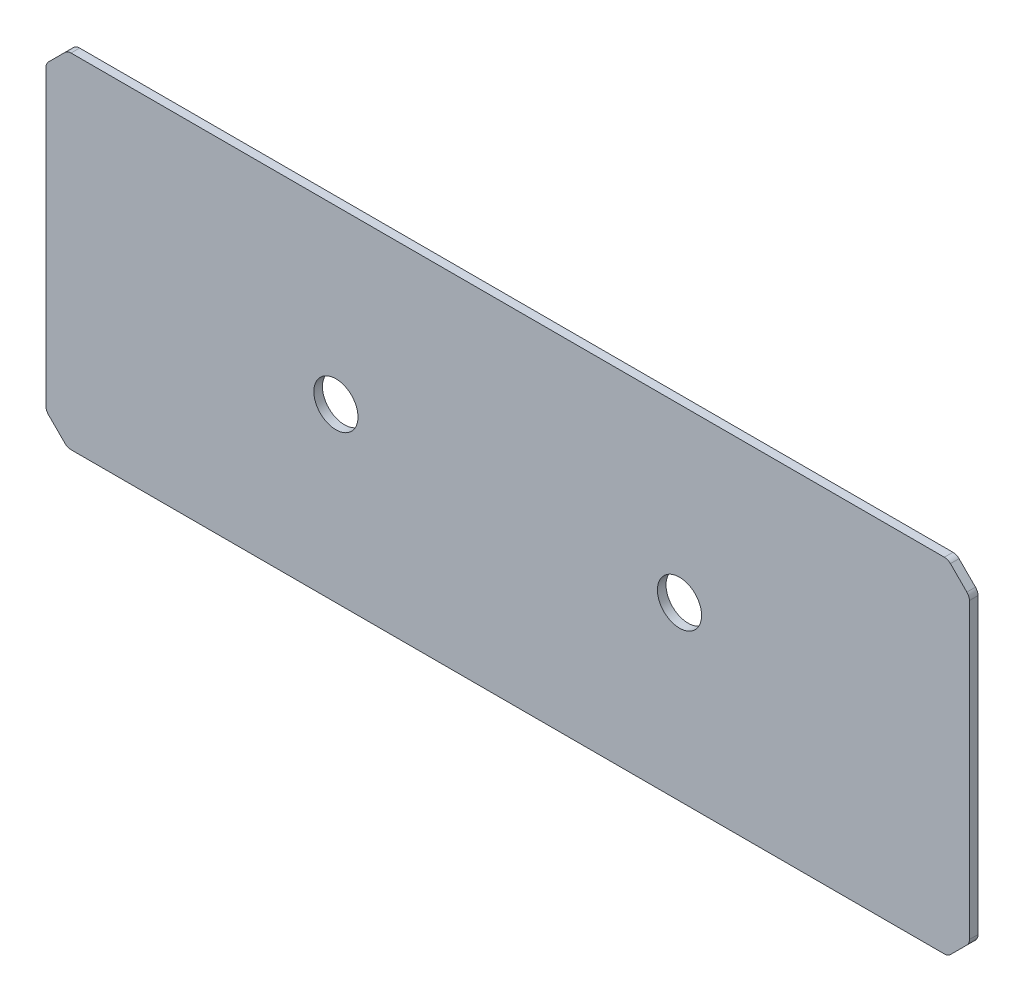
ISO-10303-21;
HEADER;
FILE_DESCRIPTION(('STEP AP214'),'2;1');
FILE_NAME('part.step','',(''),(''),'','','');
FILE_SCHEMA(('AUTOMOTIVE_DESIGN { 1 0 10303 214 1 1 1 1 }'));
ENDSEC;
DATA;
#1=APPLICATION_CONTEXT('core data for automotive mechanical design processes');
#2=APPLICATION_PROTOCOL_DEFINITION('international standard','automotive_design',2000,#1);
#3=PRODUCT_CONTEXT('',#1,'mechanical');
#4=PRODUCT('Part','Part','',(#3));
#5=PRODUCT_RELATED_PRODUCT_CATEGORY('part','',(#4));
#6=PRODUCT_DEFINITION_FORMATION('','',#4);
#7=PRODUCT_DEFINITION_CONTEXT('part definition',#1,'design');
#8=PRODUCT_DEFINITION('design','',#6,#7);
#9=PRODUCT_DEFINITION_SHAPE('','',#8);
#10=(LENGTH_UNIT() NAMED_UNIT(*) SI_UNIT(.MILLI.,.METRE.));
#11=(NAMED_UNIT(*) PLANE_ANGLE_UNIT() SI_UNIT($,.RADIAN.));
#12=(NAMED_UNIT(*) SI_UNIT($,.STERADIAN.) SOLID_ANGLE_UNIT());
#13=UNCERTAINTY_MEASURE_WITH_UNIT(LENGTH_MEASURE(1.E-05),#10,'distance_accuracy_value','');
#14=(GEOMETRIC_REPRESENTATION_CONTEXT(3) GLOBAL_UNCERTAINTY_ASSIGNED_CONTEXT((#13)) GLOBAL_UNIT_ASSIGNED_CONTEXT((#10,
#11,#12)) REPRESENTATION_CONTEXT('',''));
#15=CARTESIAN_POINT('',(0.,0.,0.));
#16=DIRECTION('',(0.,0.,1.));
#17=DIRECTION('',(1.,0.,0.));
#18=AXIS2_PLACEMENT_3D('',#15,#16,#17);
#19=CARTESIAN_POINT('',(0.,-88.046001815833,1.27));
#20=DIRECTION('',(-1.,0.,0.));
#21=DIRECTION('',(0.,0.,1.));
#22=AXIS2_PLACEMENT_3D('',#19,#20,#21);
#23=PLANE('',#22);
#24=DIRECTION('',(0.,1.,0.));
#25=VECTOR('',#24,1.);
#26=CARTESIAN_POINT('',(0.,-88.046001815833,1.27));
#27=LINE('',#26,#25);
#28=CARTESIAN_POINT('',(0.,3.70105122421385,1.27));
#29=VERTEX_POINT('',#28);
#30=CARTESIAN_POINT('',(0.,47.0989487757862,1.27));
#31=VERTEX_POINT('',#30);
#32=EDGE_CURVE('E302',#29,#31,#27,.T.);
#33=ORIENTED_EDGE('',*,*,#32,.T.);
#34=DIRECTION('',(0.,0.,1.));
#35=VECTOR('',#34,1.);
#36=CARTESIAN_POINT('',(0.,47.0989487757862,1.27));
#37=LINE('',#36,#35);
#38=CARTESIAN_POINT('',(0.,47.0989487757862,0.));
#39=VERTEX_POINT('',#38);
#40=EDGE_CURVE('E198',#31,#39,#37,.F.);
#41=ORIENTED_EDGE('',*,*,#40,.T.);
#42=DIRECTION('',(0.,1.,0.));
#43=VECTOR('',#42,1.);
#44=CARTESIAN_POINT('',(0.,-88.046001815833,0.));
#45=LINE('',#44,#43);
#46=CARTESIAN_POINT('',(0.,3.70105122421385,0.));
#47=VERTEX_POINT('',#46);
#48=EDGE_CURVE('E191',#47,#39,#45,.T.);
#49=ORIENTED_EDGE('',*,*,#48,.F.);
#50=DIRECTION('',(0.,0.,1.));
#51=VECTOR('',#50,1.);
#52=CARTESIAN_POINT('',(0.,3.70105122421385,1.27));
#53=LINE('',#52,#51);
#54=EDGE_CURVE('E204',#47,#29,#53,.T.);
#55=ORIENTED_EDGE('',*,*,#54,.T.);
#56=EDGE_LOOP('',(#33,#41,#49,#55));
#57=FACE_BOUND('',#56,.T.);
#58=ADVANCED_FACE('F72',(#57),#23,.T.);
#59=CARTESIAN_POINT('',(68.2625,-88.046001815833,0.));
#60=DIRECTION('',(0.,0.,1.));
#61=DIRECTION('',(1.,0.,0.));
#62=AXIS2_PLACEMENT_3D('',#59,#60,#61);
#63=PLANE('',#62);
#64=CARTESIAN_POINT('',(42.8625,25.4,0.));
#65=DIRECTION('',(0.,0.,1.));
#66=DIRECTION('',(1.,0.,0.));
#67=AXIS2_PLACEMENT_3D('',#64,#65,#66);
#68=CIRCLE('',#67,3.26389999999999);
#69=CARTESIAN_POINT('',(46.1264,25.4,0.));
#70=VERTEX_POINT('',#69);
#71=EDGE_CURVE('E371',#70,#70,#68,.T.);
#72=ORIENTED_EDGE('',*,*,#71,.T.);
#73=EDGE_LOOP('',(#72));
#74=FACE_BOUND('',#73,.T.);
#75=CARTESIAN_POINT('',(93.6625,25.4,0.));
#76=DIRECTION('',(0.,0.,1.));
#77=DIRECTION('',(1.,0.,0.));
#78=AXIS2_PLACEMENT_3D('',#75,#76,#77);
#79=CIRCLE('',#78,3.26389999999998);
#80=CARTESIAN_POINT('',(96.9264,25.4,0.));
#81=VERTEX_POINT('',#80);
#82=EDGE_CURVE('E294',#81,#81,#79,.T.);
#83=ORIENTED_EDGE('',*,*,#82,.T.);
#84=EDGE_LOOP('',(#83));
#85=FACE_BOUND('',#84,.T.);
#86=ORIENTED_EDGE('',*,*,#48,.T.);
#87=CARTESIAN_POINT('',(1.27,47.0989487757862,0.));
#88=DIRECTION('',(0.,0.,1.));
#89=DIRECTION('',(1.,0.,0.));
#90=AXIS2_PLACEMENT_3D('',#87,#88,#89);
#91=CIRCLE('',#90,1.27);
#92=CARTESIAN_POINT('',(0.3719743878931,47.9969743878932,0.));
#93=VERTEX_POINT('',#92);
#94=EDGE_CURVE('E230',#39,#93,#91,.F.);
#95=ORIENTED_EDGE('',*,*,#94,.T.);
#96=DIRECTION('',(-0.707106781186551,-0.707106781186544,0.));
#97=VECTOR('',#96,1.);
#98=CARTESIAN_POINT('',(0.,47.6250000000001,0.));
#99=LINE('',#98,#97);
#100=CARTESIAN_POINT('',(2.80302561210687,50.4280256121069,0.));
#101=VERTEX_POINT('',#100);
#102=EDGE_CURVE('E312',#93,#101,#99,.F.);
#103=ORIENTED_EDGE('',*,*,#102,.T.);
#104=CARTESIAN_POINT('',(3.70105122421378,49.53,0.));
#105=DIRECTION('',(0.,0.,1.));
#106=DIRECTION('',(1.,0.,0.));
#107=AXIS2_PLACEMENT_3D('',#104,#105,#106);
#108=CIRCLE('',#107,1.27);
#109=CARTESIAN_POINT('',(3.70105122421378,50.8,0.));
#110=VERTEX_POINT('',#109);
#111=EDGE_CURVE('E228',#101,#110,#108,.F.);
#112=ORIENTED_EDGE('',*,*,#111,.T.);
#113=DIRECTION('',(1.,0.,0.));
#114=VECTOR('',#113,1.);
#115=CARTESIAN_POINT('',(68.2625,50.8,0.));
#116=LINE('',#115,#114);
#117=CARTESIAN_POINT('',(132.823948775786,50.8,0.));
#118=VERTEX_POINT('',#117);
#119=EDGE_CURVE('E208',#110,#118,#116,.T.);
#120=ORIENTED_EDGE('',*,*,#119,.T.);
#121=CARTESIAN_POINT('',(132.823948775786,49.53,0.));
#122=DIRECTION('',(0.,0.,1.));
#123=DIRECTION('',(1.,0.,0.));
#124=AXIS2_PLACEMENT_3D('',#121,#122,#123);
#125=CIRCLE('',#124,1.27);
#126=CARTESIAN_POINT('',(133.721974387893,50.4280256121069,0.));
#127=VERTEX_POINT('',#126);
#128=EDGE_CURVE('E226',#118,#127,#125,.F.);
#129=ORIENTED_EDGE('',*,*,#128,.T.);
#130=DIRECTION('',(0.707106781186554,-0.707106781186541,0.));
#131=VECTOR('',#130,1.);
#132=CARTESIAN_POINT('',(133.35,50.8,0.));
#133=LINE('',#132,#131);
#134=CARTESIAN_POINT('',(136.153025612107,47.9969743878931,0.));
#135=VERTEX_POINT('',#134);
#136=EDGE_CURVE('E309',#127,#135,#133,.T.);
#137=ORIENTED_EDGE('',*,*,#136,.T.);
#138=CARTESIAN_POINT('',(135.255,47.0989487757862,0.));
#139=DIRECTION('',(0.,0.,1.));
#140=DIRECTION('',(1.,0.,0.));
#141=AXIS2_PLACEMENT_3D('',#138,#139,#140);
#142=CIRCLE('',#141,1.27);
#143=CARTESIAN_POINT('',(136.525,47.0989487757862,0.));
#144=VERTEX_POINT('',#143);
#145=EDGE_CURVE('E224',#135,#144,#142,.F.);
#146=ORIENTED_EDGE('',*,*,#145,.T.);
#147=DIRECTION('',(0.,1.,0.));
#148=VECTOR('',#147,1.);
#149=CARTESIAN_POINT('',(136.525,-88.046001815833,0.));
#150=LINE('',#149,#148);
#151=CARTESIAN_POINT('',(136.525,3.70105122421387,0.));
#152=VERTEX_POINT('',#151);
#153=EDGE_CURVE('E293',#152,#144,#150,.T.);
#154=ORIENTED_EDGE('',*,*,#153,.F.);
#155=CARTESIAN_POINT('',(135.255,3.70105122421387,0.));
#156=DIRECTION('',(0.,0.,1.));
#157=DIRECTION('',(1.,0.,0.));
#158=AXIS2_PLACEMENT_3D('',#155,#156,#157);
#159=CIRCLE('',#158,1.27);
#160=CARTESIAN_POINT('',(136.153025612107,2.80302561210695,0.));
#161=VERTEX_POINT('',#160);
#162=EDGE_CURVE('E222',#152,#161,#159,.F.);
#163=ORIENTED_EDGE('',*,*,#162,.T.);
#164=DIRECTION('',(0.707106781186549,0.707106781186546,0.));
#165=VECTOR('',#164,1.);
#166=CARTESIAN_POINT('',(136.525,3.17500000000003,0.));
#167=LINE('',#166,#165);
#168=CARTESIAN_POINT('',(133.721974387893,0.371974387893075,0.));
#169=VERTEX_POINT('',#168);
#170=EDGE_CURVE('E307',#161,#169,#167,.F.);
#171=ORIENTED_EDGE('',*,*,#170,.T.);
#172=CARTESIAN_POINT('',(132.823948775786,1.27,0.));
#173=DIRECTION('',(0.,0.,1.));
#174=DIRECTION('',(1.,0.,0.));
#175=AXIS2_PLACEMENT_3D('',#172,#173,#174);
#176=CIRCLE('',#175,1.27);
#177=CARTESIAN_POINT('',(132.823948775786,0.,0.));
#178=VERTEX_POINT('',#177);
#179=EDGE_CURVE('E220',#169,#178,#176,.F.);
#180=ORIENTED_EDGE('',*,*,#179,.T.);
#181=DIRECTION('',(1.,0.,0.));
#182=VECTOR('',#181,1.);
#183=CARTESIAN_POINT('',(68.2625,0.,0.));
#184=LINE('',#183,#182);
#185=CARTESIAN_POINT('',(3.70105122421385,0.,0.));
#186=VERTEX_POINT('',#185);
#187=EDGE_CURVE('E289',#186,#178,#184,.T.);
#188=ORIENTED_EDGE('',*,*,#187,.F.);
#189=CARTESIAN_POINT('',(3.70105122421385,1.27,0.));
#190=DIRECTION('',(0.,0.,1.));
#191=DIRECTION('',(1.,0.,0.));
#192=AXIS2_PLACEMENT_3D('',#189,#190,#191);
#193=CIRCLE('',#192,1.27);
#194=CARTESIAN_POINT('',(2.80302561210693,0.371974387893079,0.));
#195=VERTEX_POINT('',#194);
#196=EDGE_CURVE('E197',#186,#195,#193,.F.);
#197=ORIENTED_EDGE('',*,*,#196,.T.);
#198=DIRECTION('',(-0.707106781186548,0.707106781186548,0.));
#199=VECTOR('',#198,1.);
#200=CARTESIAN_POINT('',(3.17500000000001,0.,0.));
#201=LINE('',#200,#199);
#202=CARTESIAN_POINT('',(0.371974387893079,2.80302561210693,0.));
#203=VERTEX_POINT('',#202);
#204=EDGE_CURVE('E193',#195,#203,#201,.T.);
#205=ORIENTED_EDGE('',*,*,#204,.T.);
#206=CARTESIAN_POINT('',(1.27,3.70105122421385,0.));
#207=DIRECTION('',(0.,0.,1.));
#208=DIRECTION('',(1.,0.,0.));
#209=AXIS2_PLACEMENT_3D('',#206,#207,#208);
#210=CIRCLE('',#209,1.27);
#211=EDGE_CURVE('E188',#203,#47,#210,.F.);
#212=ORIENTED_EDGE('',*,*,#211,.T.);
#213=EDGE_LOOP('',(#86,#95,#103,#112,#120,#129,#137,#146,#154,#163,#171,#180,#188,#197,#205,#212));
#214=FACE_BOUND('',#213,.T.);
#215=ADVANCED_FACE('F190',(#74,#85,#214),#63,.F.);
#216=CARTESIAN_POINT('',(68.2625,50.8,1.27));
#217=DIRECTION('',(0.,1.,0.));
#218=DIRECTION('',(0.,0.,1.));
#219=AXIS2_PLACEMENT_3D('',#216,#217,#218);
#220=PLANE('',#219);
#221=ORIENTED_EDGE('',*,*,#119,.F.);
#222=DIRECTION('',(0.,0.,-1.));
#223=VECTOR('',#222,1.);
#224=CARTESIAN_POINT('',(3.70105122421378,50.8,1.27));
#225=LINE('',#224,#223);
#226=CARTESIAN_POINT('',(3.70105122421378,50.8,1.27));
#227=VERTEX_POINT('',#226);
#228=EDGE_CURVE('E252',#110,#227,#225,.F.);
#229=ORIENTED_EDGE('',*,*,#228,.T.);
#230=DIRECTION('',(1.,0.,0.));
#231=VECTOR('',#230,1.);
#232=CARTESIAN_POINT('',(68.2625,50.8,1.27));
#233=LINE('',#232,#231);
#234=CARTESIAN_POINT('',(132.823948775786,50.8,1.27));
#235=VERTEX_POINT('',#234);
#236=EDGE_CURVE('E334',#227,#235,#233,.T.);
#237=ORIENTED_EDGE('',*,*,#236,.T.);
#238=DIRECTION('',(0.,0.,-1.));
#239=VECTOR('',#238,1.);
#240=CARTESIAN_POINT('',(132.823948775786,50.8,1.27));
#241=LINE('',#240,#239);
#242=EDGE_CURVE('E249',#235,#118,#241,.T.);
#243=ORIENTED_EDGE('',*,*,#242,.T.);
#244=EDGE_LOOP('',(#221,#229,#237,#243));
#245=FACE_BOUND('',#244,.T.);
#246=ADVANCED_FACE('F332',(#245),#220,.T.);
#247=CARTESIAN_POINT('',(136.525,-88.046001815833,1.27));
#248=DIRECTION('',(-1.,0.,0.));
#249=DIRECTION('',(0.,0.,1.));
#250=AXIS2_PLACEMENT_3D('',#247,#248,#249);
#251=PLANE('',#250);
#252=ORIENTED_EDGE('',*,*,#153,.T.);
#253=DIRECTION('',(0.,0.,1.));
#254=VECTOR('',#253,1.);
#255=CARTESIAN_POINT('',(136.525,47.0989487757862,1.27));
#256=LINE('',#255,#254);
#257=CARTESIAN_POINT('',(136.525,47.0989487757862,1.27));
#258=VERTEX_POINT('',#257);
#259=EDGE_CURVE('E261',#144,#258,#256,.T.);
#260=ORIENTED_EDGE('',*,*,#259,.T.);
#261=DIRECTION('',(0.,1.,0.));
#262=VECTOR('',#261,1.);
#263=CARTESIAN_POINT('',(136.525,-88.046001815833,1.27));
#264=LINE('',#263,#262);
#265=CARTESIAN_POINT('',(136.525,3.70105122421387,1.27));
#266=VERTEX_POINT('',#265);
#267=EDGE_CURVE('E353',#266,#258,#264,.T.);
#268=ORIENTED_EDGE('',*,*,#267,.F.);
#269=DIRECTION('',(0.,0.,1.));
#270=VECTOR('',#269,1.);
#271=CARTESIAN_POINT('',(136.525,3.70105122421387,0.));
#272=LINE('',#271,#270);
#273=EDGE_CURVE('E258',#266,#152,#272,.F.);
#274=ORIENTED_EDGE('',*,*,#273,.T.);
#275=EDGE_LOOP('',(#252,#260,#268,#274));
#276=FACE_BOUND('',#275,.T.);
#277=ADVANCED_FACE('F349',(#276),#251,.F.);
#278=CARTESIAN_POINT('',(68.2625,0.,1.27));
#279=DIRECTION('',(0.,1.,0.));
#280=DIRECTION('',(0.,0.,1.));
#281=AXIS2_PLACEMENT_3D('',#278,#279,#280);
#282=PLANE('',#281);
#283=ORIENTED_EDGE('',*,*,#187,.T.);
#284=DIRECTION('',(0.,0.,-1.));
#285=VECTOR('',#284,1.);
#286=CARTESIAN_POINT('',(132.823948775786,0.,1.27));
#287=LINE('',#286,#285);
#288=CARTESIAN_POINT('',(132.823948775786,0.,1.27));
#289=VERTEX_POINT('',#288);
#290=EDGE_CURVE('E271',#178,#289,#287,.F.);
#291=ORIENTED_EDGE('',*,*,#290,.T.);
#292=DIRECTION('',(1.,0.,0.));
#293=VECTOR('',#292,1.);
#294=CARTESIAN_POINT('',(68.2625,0.,1.27));
#295=LINE('',#294,#293);
#296=CARTESIAN_POINT('',(3.70105122421385,0.,1.27));
#297=VERTEX_POINT('',#296);
#298=EDGE_CURVE('E207',#297,#289,#295,.T.);
#299=ORIENTED_EDGE('',*,*,#298,.F.);
#300=DIRECTION('',(0.,0.,-1.));
#301=VECTOR('',#300,1.);
#302=CARTESIAN_POINT('',(3.70105122421385,0.,0.));
#303=LINE('',#302,#301);
#304=EDGE_CURVE('E268',#297,#186,#303,.T.);
#305=ORIENTED_EDGE('',*,*,#304,.T.);
#306=EDGE_LOOP('',(#283,#291,#299,#305));
#307=FACE_BOUND('',#306,.T.);
#308=ADVANCED_FACE('F288',(#307),#282,.F.);
#309=CARTESIAN_POINT('',(68.2625,-88.046001815833,1.27));
#310=DIRECTION('',(0.,0.,1.));
#311=DIRECTION('',(1.,0.,0.));
#312=AXIS2_PLACEMENT_3D('',#309,#310,#311);
#313=PLANE('',#312);
#314=CARTESIAN_POINT('',(42.8625,25.4,1.27));
#315=DIRECTION('',(0.,0.,1.));
#316=DIRECTION('',(1.,0.,0.));
#317=AXIS2_PLACEMENT_3D('',#314,#315,#316);
#318=CIRCLE('',#317,3.26389999999999);
#319=CARTESIAN_POINT('',(46.1264,25.4,1.27));
#320=VERTEX_POINT('',#319);
#321=EDGE_CURVE('E369',#320,#320,#318,.T.);
#322=ORIENTED_EDGE('',*,*,#321,.F.);
#323=EDGE_LOOP('',(#322));
#324=FACE_BOUND('',#323,.T.);
#325=CARTESIAN_POINT('',(93.6625,25.4,1.27));
#326=DIRECTION('',(0.,0.,1.));
#327=DIRECTION('',(1.,0.,0.));
#328=AXIS2_PLACEMENT_3D('',#325,#326,#327);
#329=CIRCLE('',#328,3.26389999999998);
#330=CARTESIAN_POINT('',(96.9264,25.4,1.27));
#331=VERTEX_POINT('',#330);
#332=EDGE_CURVE('E299',#331,#331,#329,.T.);
#333=ORIENTED_EDGE('',*,*,#332,.F.);
#334=EDGE_LOOP('',(#333));
#335=FACE_BOUND('',#334,.T.);
#336=DIRECTION('',(0.707106781186551,0.707106781186544,0.));
#337=VECTOR('',#336,1.);
#338=CARTESIAN_POINT('',(-33.7042509079162,13.9207490920841,1.27));
#339=LINE('',#338,#337);
#340=CARTESIAN_POINT('',(2.80302561210686,50.4280256121069,1.27));
#341=VERTEX_POINT('',#340);
#342=CARTESIAN_POINT('',(0.371974387893083,47.9969743878932,1.27));
#343=VERTEX_POINT('',#342);
#344=EDGE_CURVE('E215',#341,#343,#339,.F.);
#345=ORIENTED_EDGE('',*,*,#344,.T.);
#346=CARTESIAN_POINT('',(1.27,47.0989487757862,1.27));
#347=DIRECTION('',(0.,0.,1.));
#348=DIRECTION('',(1.,0.,0.));
#349=AXIS2_PLACEMENT_3D('',#346,#347,#348);
#350=CIRCLE('',#349,1.27);
#351=EDGE_CURVE('E247',#343,#31,#350,.T.);
#352=ORIENTED_EDGE('',*,*,#351,.T.);
#353=ORIENTED_EDGE('',*,*,#32,.F.);
#354=CARTESIAN_POINT('',(1.27,3.70105122421385,1.27));
#355=DIRECTION('',(0.,0.,1.));
#356=DIRECTION('',(1.,0.,0.));
#357=AXIS2_PLACEMENT_3D('',#354,#355,#356);
#358=CIRCLE('',#357,1.27);
#359=CARTESIAN_POINT('',(0.371974387893062,2.80302561210694,1.27));
#360=VERTEX_POINT('',#359);
#361=EDGE_CURVE('E210',#29,#360,#358,.T.);
#362=ORIENTED_EDGE('',*,*,#361,.T.);
#363=DIRECTION('',(0.707106781186548,-0.707106781186548,0.));
#364=VECTOR('',#363,1.);
#365=CARTESIAN_POINT('',(79.7417509079165,-76.5667509079165,1.27));
#366=LINE('',#365,#364);
#367=CARTESIAN_POINT('',(2.80302561210691,0.37197438789309,1.27));
#368=VERTEX_POINT('',#367);
#369=EDGE_CURVE('E211',#360,#368,#366,.T.);
#370=ORIENTED_EDGE('',*,*,#369,.T.);
#371=CARTESIAN_POINT('',(3.70105122421385,1.27,1.27));
#372=DIRECTION('',(0.,0.,1.));
#373=DIRECTION('',(1.,0.,0.));
#374=AXIS2_PLACEMENT_3D('',#371,#372,#373);
#375=CIRCLE('',#374,1.27);
#376=EDGE_CURVE('E237',#368,#297,#375,.T.);
#377=ORIENTED_EDGE('',*,*,#376,.T.);
#378=ORIENTED_EDGE('',*,*,#298,.T.);
#379=CARTESIAN_POINT('',(132.823948775786,1.27,1.27));
#380=DIRECTION('',(0.,0.,1.));
#381=DIRECTION('',(1.,0.,0.));
#382=AXIS2_PLACEMENT_3D('',#379,#380,#381);
#383=CIRCLE('',#382,1.27);
#384=CARTESIAN_POINT('',(133.721974387893,0.371974387893076,1.27));
#385=VERTEX_POINT('',#384);
#386=EDGE_CURVE('E239',#289,#385,#383,.T.);
#387=ORIENTED_EDGE('',*,*,#386,.T.);
#388=DIRECTION('',(-0.707106781186549,-0.707106781186546,0.));
#389=VECTOR('',#388,1.);
#390=CARTESIAN_POINT('',(56.7832490920833,-76.5667509079163,1.27));
#391=LINE('',#390,#389);
#392=CARTESIAN_POINT('',(136.153025612107,2.80302561210695,1.27));
#393=VERTEX_POINT('',#392);
#394=EDGE_CURVE('E316',#385,#393,#391,.F.);
#395=ORIENTED_EDGE('',*,*,#394,.T.);
#396=CARTESIAN_POINT('',(135.255,3.70105122421387,1.27));
#397=DIRECTION('',(0.,0.,1.));
#398=DIRECTION('',(1.,0.,0.));
#399=AXIS2_PLACEMENT_3D('',#396,#397,#398);
#400=CIRCLE('',#399,1.27);
#401=EDGE_CURVE('E241',#393,#266,#400,.T.);
#402=ORIENTED_EDGE('',*,*,#401,.T.);
#403=ORIENTED_EDGE('',*,*,#267,.T.);
#404=CARTESIAN_POINT('',(135.255,47.0989487757862,1.27));
#405=DIRECTION('',(0.,0.,1.));
#406=DIRECTION('',(1.,0.,0.));
#407=AXIS2_PLACEMENT_3D('',#404,#405,#406);
#408=CIRCLE('',#407,1.27);
#409=CARTESIAN_POINT('',(136.153025612107,47.9969743878931,1.27));
#410=VERTEX_POINT('',#409);
#411=EDGE_CURVE('E243',#258,#410,#408,.T.);
#412=ORIENTED_EDGE('',*,*,#411,.T.);
#413=DIRECTION('',(-0.707106781186554,0.707106781186541,0.));
#414=VECTOR('',#413,1.);
#415=CARTESIAN_POINT('',(170.229250907916,13.9207490920847,1.27));
#416=LINE('',#415,#414);
#417=CARTESIAN_POINT('',(133.721974387893,50.4280256121069,1.27));
#418=VERTEX_POINT('',#417);
#419=EDGE_CURVE('E319',#410,#418,#416,.T.);
#420=ORIENTED_EDGE('',*,*,#419,.T.);
#421=CARTESIAN_POINT('',(132.823948775786,49.53,1.27));
#422=DIRECTION('',(0.,0.,1.));
#423=DIRECTION('',(1.,0.,0.));
#424=AXIS2_PLACEMENT_3D('',#421,#422,#423);
#425=CIRCLE('',#424,1.27);
#426=EDGE_CURVE('E87',#418,#235,#425,.T.);
#427=ORIENTED_EDGE('',*,*,#426,.T.);
#428=ORIENTED_EDGE('',*,*,#236,.F.);
#429=CARTESIAN_POINT('',(3.70105122421378,49.53,1.27));
#430=DIRECTION('',(0.,0.,1.));
#431=DIRECTION('',(1.,0.,0.));
#432=AXIS2_PLACEMENT_3D('',#429,#430,#431);
#433=CIRCLE('',#432,1.27);
#434=EDGE_CURVE('E95',#227,#341,#433,.T.);
#435=ORIENTED_EDGE('',*,*,#434,.T.);
#436=EDGE_LOOP('',(#345,#352,#353,#362,#370,#377,#378,#387,#395,#402,#403,#412,#420,#427,#428,#435));
#437=FACE_BOUND('',#436,.T.);
#438=ADVANCED_FACE('F279',(#324,#335,#437),#313,.T.);
#439=CARTESIAN_POINT('',(93.6625,25.4,0.));
#440=DIRECTION('',(0.,0.,1.));
#441=DIRECTION('',(1.,0.,0.));
#442=AXIS2_PLACEMENT_3D('',#439,#440,#441);
#443=CYLINDRICAL_SURFACE('',#442,3.26389999999998);
#444=ORIENTED_EDGE('',*,*,#82,.F.);
#445=EDGE_LOOP('',(#444));
#446=FACE_BOUND('',#445,.T.);
#447=ORIENTED_EDGE('',*,*,#332,.T.);
#448=EDGE_LOOP('',(#447));
#449=FACE_BOUND('',#448,.T.);
#450=ADVANCED_FACE('F381',(#446,#449),#443,.F.);
#451=CARTESIAN_POINT('',(42.8625,25.4,0.));
#452=DIRECTION('',(0.,0.,1.));
#453=DIRECTION('',(1.,0.,0.));
#454=AXIS2_PLACEMENT_3D('',#451,#452,#453);
#455=CYLINDRICAL_SURFACE('',#454,3.26389999999999);
#456=ORIENTED_EDGE('',*,*,#71,.F.);
#457=EDGE_LOOP('',(#456));
#458=FACE_BOUND('',#457,.T.);
#459=ORIENTED_EDGE('',*,*,#321,.T.);
#460=EDGE_LOOP('',(#459));
#461=FACE_BOUND('',#460,.T.);
#462=ADVANCED_FACE('F377',(#458,#461),#455,.F.);
#463=CARTESIAN_POINT('',(3.17500000000001,0.,1.27));
#464=DIRECTION('',(-0.707106781186548,-0.707106781186548,0.));
#465=DIRECTION('',(0.707106781186548,-0.707106781186548,0.));
#466=AXIS2_PLACEMENT_3D('',#463,#464,#465);
#467=PLANE('',#466);
#468=ORIENTED_EDGE('',*,*,#204,.F.);
#469=DIRECTION('',(0.,0.,-1.));
#470=VECTOR('',#469,1.);
#471=CARTESIAN_POINT('',(2.80302561210693,0.371974387893079,1.27));
#472=LINE('',#471,#470);
#473=EDGE_CURVE('E12',#195,#368,#472,.F.);
#474=ORIENTED_EDGE('',*,*,#473,.T.);
#475=ORIENTED_EDGE('',*,*,#369,.F.);
#476=DIRECTION('',(0.,0.,1.));
#477=VECTOR('',#476,1.);
#478=CARTESIAN_POINT('',(0.37197438789308,2.80302561210693,1.27));
#479=LINE('',#478,#477);
#480=EDGE_CURVE('E80',#360,#203,#479,.F.);
#481=ORIENTED_EDGE('',*,*,#480,.T.);
#482=EDGE_LOOP('',(#468,#474,#475,#481));
#483=FACE_BOUND('',#482,.T.);
#484=ADVANCED_FACE('F275',(#483),#467,.T.);
#485=CARTESIAN_POINT('',(0.,47.6250000000001,1.27));
#486=DIRECTION('',(0.707106781186544,-0.707106781186551,0.));
#487=DIRECTION('',(0.707106781186551,0.707106781186544,0.));
#488=AXIS2_PLACEMENT_3D('',#485,#486,#487);
#489=PLANE('',#488);
#490=ORIENTED_EDGE('',*,*,#102,.F.);
#491=DIRECTION('',(0.,0.,-1.));
#492=VECTOR('',#491,1.);
#493=CARTESIAN_POINT('',(0.371974387893099,47.9969743878932,1.27));
#494=LINE('',#493,#492);
#495=EDGE_CURVE('E234',#93,#343,#494,.F.);
#496=ORIENTED_EDGE('',*,*,#495,.T.);
#497=ORIENTED_EDGE('',*,*,#344,.F.);
#498=DIRECTION('',(0.,0.,1.));
#499=VECTOR('',#498,1.);
#500=CARTESIAN_POINT('',(2.80302561210687,50.4280256121069,1.27));
#501=LINE('',#500,#499);
#502=EDGE_CURVE('E232',#341,#101,#501,.F.);
#503=ORIENTED_EDGE('',*,*,#502,.T.);
#504=EDGE_LOOP('',(#490,#496,#497,#503));
#505=FACE_BOUND('',#504,.T.);
#506=ADVANCED_FACE('F328',(#505),#489,.F.);
#507=CARTESIAN_POINT('',(133.35,50.8,1.27));
#508=DIRECTION('',(0.707106781186541,0.707106781186554,0.));
#509=DIRECTION('',(-0.707106781186554,0.707106781186541,0.));
#510=AXIS2_PLACEMENT_3D('',#507,#508,#509);
#511=PLANE('',#510);
#512=ORIENTED_EDGE('',*,*,#136,.F.);
#513=DIRECTION('',(0.,0.,-1.));
#514=VECTOR('',#513,1.);
#515=CARTESIAN_POINT('',(133.721974387893,50.4280256121069,1.27));
#516=LINE('',#515,#514);
#517=EDGE_CURVE('E256',#127,#418,#516,.F.);
#518=ORIENTED_EDGE('',*,*,#517,.T.);
#519=ORIENTED_EDGE('',*,*,#419,.F.);
#520=DIRECTION('',(0.,0.,1.));
#521=VECTOR('',#520,1.);
#522=CARTESIAN_POINT('',(136.153025612107,47.9969743878931,0.));
#523=LINE('',#522,#521);
#524=EDGE_CURVE('E254',#410,#135,#523,.F.);
#525=ORIENTED_EDGE('',*,*,#524,.T.);
#526=EDGE_LOOP('',(#512,#518,#519,#525));
#527=FACE_BOUND('',#526,.T.);
#528=ADVANCED_FACE('F341',(#527),#511,.T.);
#529=CARTESIAN_POINT('',(136.525,3.17500000000003,1.27));
#530=DIRECTION('',(-0.707106781186546,0.707106781186549,0.));
#531=DIRECTION('',(-0.707106781186549,-0.707106781186546,0.));
#532=AXIS2_PLACEMENT_3D('',#529,#530,#531);
#533=PLANE('',#532);
#534=ORIENTED_EDGE('',*,*,#170,.F.);
#535=DIRECTION('',(0.,0.,-1.));
#536=VECTOR('',#535,1.);
#537=CARTESIAN_POINT('',(136.153025612107,2.80302561210695,1.27));
#538=LINE('',#537,#536);
#539=EDGE_CURVE('E266',#161,#393,#538,.F.);
#540=ORIENTED_EDGE('',*,*,#539,.T.);
#541=ORIENTED_EDGE('',*,*,#394,.F.);
#542=DIRECTION('',(0.,0.,1.));
#543=VECTOR('',#542,1.);
#544=CARTESIAN_POINT('',(133.721974387893,0.371974387893075,0.));
#545=LINE('',#544,#543);
#546=EDGE_CURVE('E264',#385,#169,#545,.F.);
#547=ORIENTED_EDGE('',*,*,#546,.T.);
#548=EDGE_LOOP('',(#534,#540,#541,#547));
#549=FACE_BOUND('',#548,.T.);
#550=ADVANCED_FACE('F360',(#549),#533,.F.);
#551=CARTESIAN_POINT('',(1.27,47.0989487757862,1.27));
#552=DIRECTION('',(0.,0.,1.));
#553=DIRECTION('',(1.,0.,0.));
#554=AXIS2_PLACEMENT_3D('',#551,#552,#553);
#555=CYLINDRICAL_SURFACE('',#554,1.27);
#556=ORIENTED_EDGE('',*,*,#351,.F.);
#557=ORIENTED_EDGE('',*,*,#495,.F.);
#558=ORIENTED_EDGE('',*,*,#94,.F.);
#559=ORIENTED_EDGE('',*,*,#40,.F.);
#560=EDGE_LOOP('',(#556,#557,#558,#559));
#561=FACE_BOUND('',#560,.T.);
#562=ADVANCED_FACE('F325',(#561),#555,.T.);
#563=CARTESIAN_POINT('',(3.70105122421378,49.53,1.27));
#564=DIRECTION('',(0.,0.,-1.));
#565=DIRECTION('',(-1.,0.,0.));
#566=AXIS2_PLACEMENT_3D('',#563,#564,#565);
#567=CYLINDRICAL_SURFACE('',#566,1.27);
#568=ORIENTED_EDGE('',*,*,#111,.F.);
#569=ORIENTED_EDGE('',*,*,#502,.F.);
#570=ORIENTED_EDGE('',*,*,#434,.F.);
#571=ORIENTED_EDGE('',*,*,#228,.F.);
#572=EDGE_LOOP('',(#568,#569,#570,#571));
#573=FACE_BOUND('',#572,.T.);
#574=ADVANCED_FACE('F329',(#573),#567,.T.);
#575=CARTESIAN_POINT('',(132.823948775786,49.53,1.27));
#576=DIRECTION('',(0.,0.,-1.));
#577=DIRECTION('',(-1.,0.,0.));
#578=AXIS2_PLACEMENT_3D('',#575,#576,#577);
#579=CYLINDRICAL_SURFACE('',#578,1.27);
#580=ORIENTED_EDGE('',*,*,#426,.F.);
#581=ORIENTED_EDGE('',*,*,#517,.F.);
#582=ORIENTED_EDGE('',*,*,#128,.F.);
#583=ORIENTED_EDGE('',*,*,#242,.F.);
#584=EDGE_LOOP('',(#580,#581,#582,#583));
#585=FACE_BOUND('',#584,.T.);
#586=ADVANCED_FACE('F336',(#585),#579,.T.);
#587=CARTESIAN_POINT('',(135.255,47.0989487757862,1.27));
#588=DIRECTION('',(0.,0.,-1.));
#589=DIRECTION('',(-1.,0.,0.));
#590=AXIS2_PLACEMENT_3D('',#587,#588,#589);
#591=CYLINDRICAL_SURFACE('',#590,1.27);
#592=ORIENTED_EDGE('',*,*,#145,.F.);
#593=ORIENTED_EDGE('',*,*,#524,.F.);
#594=ORIENTED_EDGE('',*,*,#411,.F.);
#595=ORIENTED_EDGE('',*,*,#259,.F.);
#596=EDGE_LOOP('',(#592,#593,#594,#595));
#597=FACE_BOUND('',#596,.T.);
#598=ADVANCED_FACE('F345',(#597),#591,.T.);
#599=CARTESIAN_POINT('',(135.255,3.70105122421387,1.27));
#600=DIRECTION('',(0.,0.,-1.));
#601=DIRECTION('',(-1.,0.,0.));
#602=AXIS2_PLACEMENT_3D('',#599,#600,#601);
#603=CYLINDRICAL_SURFACE('',#602,1.27);
#604=ORIENTED_EDGE('',*,*,#401,.F.);
#605=ORIENTED_EDGE('',*,*,#539,.F.);
#606=ORIENTED_EDGE('',*,*,#162,.F.);
#607=ORIENTED_EDGE('',*,*,#273,.F.);
#608=EDGE_LOOP('',(#604,#605,#606,#607));
#609=FACE_BOUND('',#608,.T.);
#610=ADVANCED_FACE('F356',(#609),#603,.T.);
#611=CARTESIAN_POINT('',(132.823948775786,1.27,1.27));
#612=DIRECTION('',(0.,0.,1.));
#613=DIRECTION('',(1.,0.,0.));
#614=AXIS2_PLACEMENT_3D('',#611,#612,#613);
#615=CYLINDRICAL_SURFACE('',#614,1.27);
#616=ORIENTED_EDGE('',*,*,#179,.F.);
#617=ORIENTED_EDGE('',*,*,#546,.F.);
#618=ORIENTED_EDGE('',*,*,#386,.F.);
#619=ORIENTED_EDGE('',*,*,#290,.F.);
#620=EDGE_LOOP('',(#616,#617,#618,#619));
#621=FACE_BOUND('',#620,.T.);
#622=ADVANCED_FACE('F364',(#621),#615,.T.);
#623=CARTESIAN_POINT('',(3.70105122421385,1.27,1.27));
#624=DIRECTION('',(0.,0.,1.));
#625=DIRECTION('',(1.,0.,0.));
#626=AXIS2_PLACEMENT_3D('',#623,#624,#625);
#627=CYLINDRICAL_SURFACE('',#626,1.27);
#628=ORIENTED_EDGE('',*,*,#376,.F.);
#629=ORIENTED_EDGE('',*,*,#473,.F.);
#630=ORIENTED_EDGE('',*,*,#196,.F.);
#631=ORIENTED_EDGE('',*,*,#304,.F.);
#632=EDGE_LOOP('',(#628,#629,#630,#631));
#633=FACE_BOUND('',#632,.T.);
#634=ADVANCED_FACE('F284',(#633),#627,.T.);
#635=CARTESIAN_POINT('',(1.27,3.70105122421385,1.27));
#636=DIRECTION('',(0.,0.,1.));
#637=DIRECTION('',(1.,0.,0.));
#638=AXIS2_PLACEMENT_3D('',#635,#636,#637);
#639=CYLINDRICAL_SURFACE('',#638,1.27);
#640=ORIENTED_EDGE('',*,*,#211,.F.);
#641=ORIENTED_EDGE('',*,*,#480,.F.);
#642=ORIENTED_EDGE('',*,*,#361,.F.);
#643=ORIENTED_EDGE('',*,*,#54,.F.);
#644=EDGE_LOOP('',(#640,#641,#642,#643));
#645=FACE_BOUND('',#644,.T.);
#646=ADVANCED_FACE('F74',(#645),#639,.T.);
#647=CLOSED_SHELL('',(#58,#215,#246,#277,#308,#438,#450,#462,#484,#506,#528,#550,#562,#574,#586,
#598,#610,#622,#634,#646));
#648=MANIFOLD_SOLID_BREP('B2',#647);
#649=ADVANCED_BREP_SHAPE_REPRESENTATION('',(#18,#648),#14);
#650=SHAPE_DEFINITION_REPRESENTATION(#9,#649);
ENDSEC;
END-ISO-10303-21;
